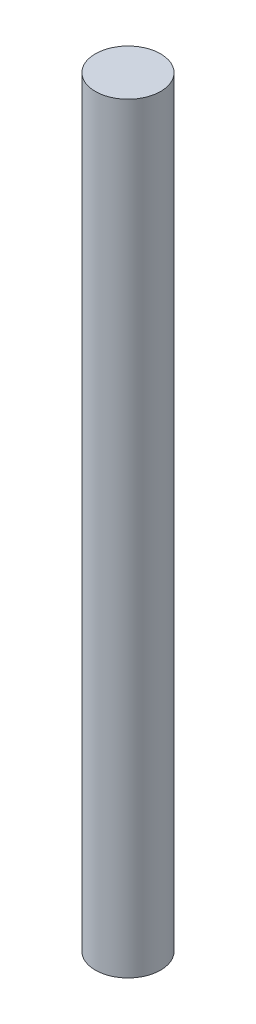
ISO-10303-21;
HEADER;
FILE_DESCRIPTION(('STEP AP214'),'2;1');
FILE_NAME('part.step','',(''),(''),'','','');
FILE_SCHEMA(('AUTOMOTIVE_DESIGN { 1 0 10303 214 1 1 1 1 }'));
ENDSEC;
DATA;
#1=APPLICATION_CONTEXT('core data for automotive mechanical design processes');
#2=APPLICATION_PROTOCOL_DEFINITION('international standard','automotive_design',2000,#1);
#3=PRODUCT_CONTEXT('',#1,'mechanical');
#4=PRODUCT('Part','Part','',(#3));
#5=PRODUCT_RELATED_PRODUCT_CATEGORY('part','',(#4));
#6=PRODUCT_DEFINITION_FORMATION('','',#4);
#7=PRODUCT_DEFINITION_CONTEXT('part definition',#1,'design');
#8=PRODUCT_DEFINITION('design','',#6,#7);
#9=PRODUCT_DEFINITION_SHAPE('','',#8);
#10=(LENGTH_UNIT() NAMED_UNIT(*) SI_UNIT(.MILLI.,.METRE.));
#11=(NAMED_UNIT(*) PLANE_ANGLE_UNIT() SI_UNIT($,.RADIAN.));
#12=(NAMED_UNIT(*) SI_UNIT($,.STERADIAN.) SOLID_ANGLE_UNIT());
#13=UNCERTAINTY_MEASURE_WITH_UNIT(LENGTH_MEASURE(1.E-05),#10,'distance_accuracy_value','');
#14=(GEOMETRIC_REPRESENTATION_CONTEXT(3) GLOBAL_UNCERTAINTY_ASSIGNED_CONTEXT((#13)) GLOBAL_UNIT_ASSIGNED_CONTEXT((#10,
#11,#12)) REPRESENTATION_CONTEXT('',''));
#15=CARTESIAN_POINT('',(0.,0.,0.));
#16=DIRECTION('',(0.,0.,1.));
#17=DIRECTION('',(1.,0.,0.));
#18=AXIS2_PLACEMENT_3D('',#15,#16,#17);
#19=CARTESIAN_POINT('',(0.,35.,0.));
#20=DIRECTION('',(0.,-1.,0.));
#21=DIRECTION('',(0.,0.,-1.));
#22=AXIS2_PLACEMENT_3D('',#19,#20,#21);
#23=CYLINDRICAL_SURFACE('',#22,1.5);
#24=CARTESIAN_POINT('',(0.,35.,0.));
#25=DIRECTION('',(0.,1.,0.));
#26=DIRECTION('',(0.,0.,1.));
#27=AXIS2_PLACEMENT_3D('',#24,#25,#26);
#28=CIRCLE('',#27,1.5);
#29=CARTESIAN_POINT('',(0.,35.,1.5));
#30=VERTEX_POINT('',#29);
#31=EDGE_CURVE('E10',#30,#30,#28,.T.);
#32=ORIENTED_EDGE('',*,*,#31,.F.);
#33=EDGE_LOOP('',(#32));
#34=FACE_BOUND('',#33,.T.);
#35=CARTESIAN_POINT('',(0.,0.,0.));
#36=DIRECTION('',(0.,1.,0.));
#37=DIRECTION('',(0.,0.,1.));
#38=AXIS2_PLACEMENT_3D('',#35,#36,#37);
#39=CIRCLE('',#38,1.5);
#40=CARTESIAN_POINT('',(0.,0.,1.5));
#41=VERTEX_POINT('',#40);
#42=EDGE_CURVE('E32',#41,#41,#39,.T.);
#43=ORIENTED_EDGE('',*,*,#42,.T.);
#44=EDGE_LOOP('',(#43));
#45=FACE_BOUND('',#44,.T.);
#46=ADVANCED_FACE('F29',(#34,#45),#23,.T.);
#47=CARTESIAN_POINT('',(0.,35.,0.));
#48=DIRECTION('',(0.,1.,0.));
#49=DIRECTION('',(0.,0.,1.));
#50=AXIS2_PLACEMENT_3D('',#47,#48,#49);
#51=PLANE('',#50);
#52=ORIENTED_EDGE('',*,*,#31,.T.);
#53=EDGE_LOOP('',(#52));
#54=FACE_BOUND('',#53,.T.);
#55=ADVANCED_FACE('F44',(#54),#51,.T.);
#56=CARTESIAN_POINT('',(0.,0.,0.));
#57=DIRECTION('',(0.,1.,0.));
#58=DIRECTION('',(0.,0.,1.));
#59=AXIS2_PLACEMENT_3D('',#56,#57,#58);
#60=PLANE('',#59);
#61=ORIENTED_EDGE('',*,*,#42,.F.);
#62=EDGE_LOOP('',(#61));
#63=FACE_BOUND('',#62,.T.);
#64=ADVANCED_FACE('F42',(#63),#60,.F.);
#65=CLOSED_SHELL('',(#46,#55,#64));
#66=MANIFOLD_SOLID_BREP('B2',#65);
#67=ADVANCED_BREP_SHAPE_REPRESENTATION('',(#18,#66),#14);
#68=SHAPE_DEFINITION_REPRESENTATION(#9,#67);
ENDSEC;
END-ISO-10303-21;
